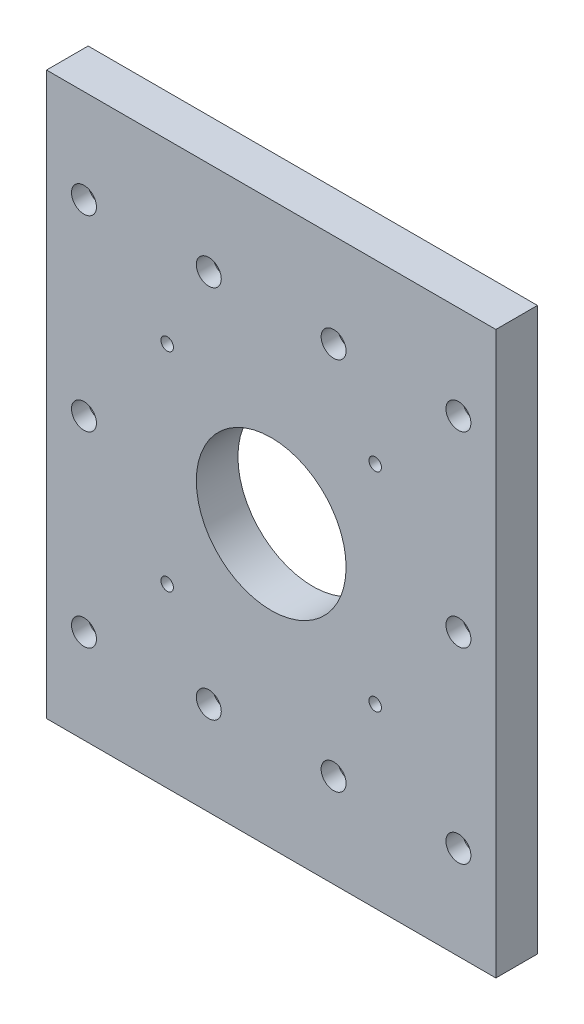
ISO-10303-21;
HEADER;
FILE_DESCRIPTION(('STEP AP214'),'2;1');
FILE_NAME('part.step','',(''),(''),'','','');
FILE_SCHEMA(('AUTOMOTIVE_DESIGN { 1 0 10303 214 1 1 1 1 }'));
ENDSEC;
DATA;
#1=APPLICATION_CONTEXT('core data for automotive mechanical design processes');
#2=APPLICATION_PROTOCOL_DEFINITION('international standard','automotive_design',2000,#1);
#3=PRODUCT_CONTEXT('',#1,'mechanical');
#4=PRODUCT('Part','Part','',(#3));
#5=PRODUCT_RELATED_PRODUCT_CATEGORY('part','',(#4));
#6=PRODUCT_DEFINITION_FORMATION('','',#4);
#7=PRODUCT_DEFINITION_CONTEXT('part definition',#1,'design');
#8=PRODUCT_DEFINITION('design','',#6,#7);
#9=PRODUCT_DEFINITION_SHAPE('','',#8);
#10=(LENGTH_UNIT() NAMED_UNIT(*) SI_UNIT(.MILLI.,.METRE.));
#11=(NAMED_UNIT(*) PLANE_ANGLE_UNIT() SI_UNIT($,.RADIAN.));
#12=(NAMED_UNIT(*) SI_UNIT($,.STERADIAN.) SOLID_ANGLE_UNIT());
#13=UNCERTAINTY_MEASURE_WITH_UNIT(LENGTH_MEASURE(1.E-05),#10,'distance_accuracy_value','');
#14=(GEOMETRIC_REPRESENTATION_CONTEXT(3) GLOBAL_UNCERTAINTY_ASSIGNED_CONTEXT((#13)) GLOBAL_UNIT_ASSIGNED_CONTEXT((#10,
#11,#12)) REPRESENTATION_CONTEXT('',''));
#15=CARTESIAN_POINT('',(0.,0.,0.));
#16=DIRECTION('',(0.,0.,1.));
#17=DIRECTION('',(1.,0.,0.));
#18=AXIS2_PLACEMENT_3D('',#15,#16,#17);
#19=CARTESIAN_POINT('',(5.,22.5,10.));
#20=DIRECTION('',(0.,0.,-1.));
#21=DIRECTION('',(-1.,0.,0.));
#22=AXIS2_PLACEMENT_3D('',#19,#20,#21);
#23=CYLINDRICAL_SURFACE('',#22,3.);
#24=CARTESIAN_POINT('',(5.,22.5,10.));
#25=DIRECTION('',(0.,0.,1.));
#26=DIRECTION('',(1.,0.,0.));
#27=AXIS2_PLACEMENT_3D('',#24,#25,#26);
#28=CIRCLE('',#27,3.);
#29=CARTESIAN_POINT('',(8.,22.5,10.));
#30=VERTEX_POINT('',#29);
#31=EDGE_CURVE('E127',#30,#30,#28,.T.);
#32=ORIENTED_EDGE('',*,*,#31,.T.);
#33=EDGE_LOOP('',(#32));
#34=FACE_BOUND('',#33,.T.);
#35=CARTESIAN_POINT('',(5.,22.5,6.));
#36=DIRECTION('',(0.,0.,-1.));
#37=DIRECTION('',(-1.,0.,0.));
#38=AXIS2_PLACEMENT_3D('',#35,#36,#37);
#39=CIRCLE('',#38,3.);
#40=CARTESIAN_POINT('',(2.,22.5,6.));
#41=VERTEX_POINT('',#40);
#42=EDGE_CURVE('E33',#41,#41,#39,.T.);
#43=ORIENTED_EDGE('',*,*,#42,.T.);
#44=EDGE_LOOP('',(#43));
#45=FACE_BOUND('',#44,.T.);
#46=ADVANCED_FACE('F29',(#34,#45),#23,.F.);
#47=CARTESIAN_POINT('',(-25.,67.5,10.));
#48=DIRECTION('',(0.,0.,-1.));
#49=DIRECTION('',(-1.,0.,0.));
#50=AXIS2_PLACEMENT_3D('',#47,#48,#49);
#51=CYLINDRICAL_SURFACE('',#50,3.);
#52=CARTESIAN_POINT('',(-25.,67.5,10.));
#53=DIRECTION('',(0.,0.,1.));
#54=DIRECTION('',(1.,0.,0.));
#55=AXIS2_PLACEMENT_3D('',#52,#53,#54);
#56=CIRCLE('',#55,3.);
#57=CARTESIAN_POINT('',(-22.,67.5,10.));
#58=VERTEX_POINT('',#57);
#59=EDGE_CURVE('E100',#58,#58,#56,.T.);
#60=ORIENTED_EDGE('',*,*,#59,.T.);
#61=EDGE_LOOP('',(#60));
#62=FACE_BOUND('',#61,.T.);
#63=CARTESIAN_POINT('',(-25.,67.5,6.));
#64=DIRECTION('',(0.,0.,-1.));
#65=DIRECTION('',(-1.,0.,0.));
#66=AXIS2_PLACEMENT_3D('',#63,#64,#65);
#67=CIRCLE('',#66,3.);
#68=CARTESIAN_POINT('',(-28.,67.5,6.));
#69=VERTEX_POINT('',#68);
#70=EDGE_CURVE('E191',#69,#69,#67,.T.);
#71=ORIENTED_EDGE('',*,*,#70,.T.);
#72=EDGE_LOOP('',(#71));
#73=FACE_BOUND('',#72,.T.);
#74=ADVANCED_FACE('F31',(#62,#73),#51,.F.);
#75=CARTESIAN_POINT('',(65.,67.5,10.));
#76=DIRECTION('',(0.,0.,-1.));
#77=DIRECTION('',(-1.,0.,0.));
#78=AXIS2_PLACEMENT_3D('',#75,#76,#77);
#79=CYLINDRICAL_SURFACE('',#78,3.00000000000001);
#80=CARTESIAN_POINT('',(65.,67.5,10.));
#81=DIRECTION('',(0.,0.,1.));
#82=DIRECTION('',(1.,0.,0.));
#83=AXIS2_PLACEMENT_3D('',#80,#81,#82);
#84=CIRCLE('',#83,3.00000000000001);
#85=CARTESIAN_POINT('',(68.,67.5,10.));
#86=VERTEX_POINT('',#85);
#87=EDGE_CURVE('E103',#86,#86,#84,.T.);
#88=ORIENTED_EDGE('',*,*,#87,.T.);
#89=EDGE_LOOP('',(#88));
#90=FACE_BOUND('',#89,.T.);
#91=CARTESIAN_POINT('',(65.,67.5,6.));
#92=DIRECTION('',(0.,0.,-1.));
#93=DIRECTION('',(-1.,0.,0.));
#94=AXIS2_PLACEMENT_3D('',#91,#92,#93);
#95=CIRCLE('',#94,3.00000000000001);
#96=CARTESIAN_POINT('',(62.,67.5,6.));
#97=VERTEX_POINT('',#96);
#98=EDGE_CURVE('E187',#97,#97,#95,.T.);
#99=ORIENTED_EDGE('',*,*,#98,.T.);
#100=EDGE_LOOP('',(#99));
#101=FACE_BOUND('',#100,.T.);
#102=ADVANCED_FACE('F271',(#90,#101),#79,.F.);
#103=CARTESIAN_POINT('',(-25.,112.5,10.));
#104=DIRECTION('',(0.,0.,-1.));
#105=DIRECTION('',(-1.,0.,0.));
#106=AXIS2_PLACEMENT_3D('',#103,#104,#105);
#107=CYLINDRICAL_SURFACE('',#106,3.);
#108=CARTESIAN_POINT('',(-25.,112.5,10.));
#109=DIRECTION('',(0.,0.,1.));
#110=DIRECTION('',(1.,0.,0.));
#111=AXIS2_PLACEMENT_3D('',#108,#109,#110);
#112=CIRCLE('',#111,3.);
#113=CARTESIAN_POINT('',(-22.,112.5,10.));
#114=VERTEX_POINT('',#113);
#115=EDGE_CURVE('E115',#114,#114,#112,.T.);
#116=ORIENTED_EDGE('',*,*,#115,.T.);
#117=EDGE_LOOP('',(#116));
#118=FACE_BOUND('',#117,.T.);
#119=CARTESIAN_POINT('',(-25.,112.5,6.));
#120=DIRECTION('',(0.,0.,-1.));
#121=DIRECTION('',(-1.,0.,0.));
#122=AXIS2_PLACEMENT_3D('',#119,#120,#121);
#123=CIRCLE('',#122,3.);
#124=CARTESIAN_POINT('',(-28.,112.5,6.));
#125=VERTEX_POINT('',#124);
#126=EDGE_CURVE('E182',#125,#125,#123,.T.);
#127=ORIENTED_EDGE('',*,*,#126,.T.);
#128=EDGE_LOOP('',(#127));
#129=FACE_BOUND('',#128,.T.);
#130=ADVANCED_FACE('F284',(#118,#129),#107,.F.);
#131=CARTESIAN_POINT('',(35.,22.5,10.));
#132=DIRECTION('',(0.,0.,-1.));
#133=DIRECTION('',(-1.,0.,0.));
#134=AXIS2_PLACEMENT_3D('',#131,#132,#133);
#135=CYLINDRICAL_SURFACE('',#134,3.);
#136=CARTESIAN_POINT('',(35.,22.5,10.));
#137=DIRECTION('',(0.,0.,1.));
#138=DIRECTION('',(1.,0.,0.));
#139=AXIS2_PLACEMENT_3D('',#136,#137,#138);
#140=CIRCLE('',#139,3.);
#141=CARTESIAN_POINT('',(38.,22.5,10.));
#142=VERTEX_POINT('',#141);
#143=EDGE_CURVE('E118',#142,#142,#140,.T.);
#144=ORIENTED_EDGE('',*,*,#143,.T.);
#145=EDGE_LOOP('',(#144));
#146=FACE_BOUND('',#145,.T.);
#147=CARTESIAN_POINT('',(35.,22.5,6.));
#148=DIRECTION('',(0.,0.,-1.));
#149=DIRECTION('',(-1.,0.,0.));
#150=AXIS2_PLACEMENT_3D('',#147,#148,#149);
#151=CIRCLE('',#150,3.);
#152=CARTESIAN_POINT('',(32.,22.5,6.));
#153=VERTEX_POINT('',#152);
#154=EDGE_CURVE('E177',#153,#153,#151,.T.);
#155=ORIENTED_EDGE('',*,*,#154,.T.);
#156=EDGE_LOOP('',(#155));
#157=FACE_BOUND('',#156,.T.);
#158=ADVANCED_FACE('F280',(#146,#157),#135,.F.);
#159=CARTESIAN_POINT('',(5.,112.5,10.));
#160=DIRECTION('',(0.,0.,-1.));
#161=DIRECTION('',(-1.,0.,0.));
#162=AXIS2_PLACEMENT_3D('',#159,#160,#161);
#163=CYLINDRICAL_SURFACE('',#162,3.);
#164=CARTESIAN_POINT('',(5.,112.5,10.));
#165=DIRECTION('',(0.,0.,1.));
#166=DIRECTION('',(1.,0.,0.));
#167=AXIS2_PLACEMENT_3D('',#164,#165,#166);
#168=CIRCLE('',#167,3.);
#169=CARTESIAN_POINT('',(8.,112.5,10.));
#170=VERTEX_POINT('',#169);
#171=EDGE_CURVE('E139',#170,#170,#168,.T.);
#172=ORIENTED_EDGE('',*,*,#171,.T.);
#173=EDGE_LOOP('',(#172));
#174=FACE_BOUND('',#173,.T.);
#175=CARTESIAN_POINT('',(5.,112.5,6.));
#176=DIRECTION('',(0.,0.,-1.));
#177=DIRECTION('',(-1.,0.,0.));
#178=AXIS2_PLACEMENT_3D('',#175,#176,#177);
#179=CIRCLE('',#178,3.);
#180=CARTESIAN_POINT('',(2.,112.5,6.));
#181=VERTEX_POINT('',#180);
#182=EDGE_CURVE('E172',#181,#181,#179,.T.);
#183=ORIENTED_EDGE('',*,*,#182,.T.);
#184=EDGE_LOOP('',(#183));
#185=FACE_BOUND('',#184,.T.);
#186=ADVANCED_FACE('F283',(#174,#185),#163,.F.);
#187=CARTESIAN_POINT('',(-25.,22.5,10.));
#188=DIRECTION('',(0.,0.,-1.));
#189=DIRECTION('',(-1.,0.,0.));
#190=AXIS2_PLACEMENT_3D('',#187,#188,#189);
#191=CYLINDRICAL_SURFACE('',#190,3.);
#192=CARTESIAN_POINT('',(-25.,22.5,10.));
#193=DIRECTION('',(0.,0.,1.));
#194=DIRECTION('',(1.,0.,0.));
#195=AXIS2_PLACEMENT_3D('',#192,#193,#194);
#196=CIRCLE('',#195,3.);
#197=CARTESIAN_POINT('',(-22.,22.5,10.));
#198=VERTEX_POINT('',#197);
#199=EDGE_CURVE('E106',#198,#198,#196,.T.);
#200=ORIENTED_EDGE('',*,*,#199,.T.);
#201=EDGE_LOOP('',(#200));
#202=FACE_BOUND('',#201,.T.);
#203=CARTESIAN_POINT('',(-25.,22.5,6.));
#204=DIRECTION('',(0.,0.,-1.));
#205=DIRECTION('',(-1.,0.,0.));
#206=AXIS2_PLACEMENT_3D('',#203,#204,#205);
#207=CIRCLE('',#206,3.);
#208=CARTESIAN_POINT('',(-28.,22.5,6.));
#209=VERTEX_POINT('',#208);
#210=EDGE_CURVE('E167',#209,#209,#207,.T.);
#211=ORIENTED_EDGE('',*,*,#210,.T.);
#212=EDGE_LOOP('',(#211));
#213=FACE_BOUND('',#212,.T.);
#214=ADVANCED_FACE('F296',(#202,#213),#191,.F.);
#215=CARTESIAN_POINT('',(65.,22.5,10.));
#216=DIRECTION('',(0.,0.,-1.));
#217=DIRECTION('',(-1.,0.,0.));
#218=AXIS2_PLACEMENT_3D('',#215,#216,#217);
#219=CYLINDRICAL_SURFACE('',#218,3.00000000000001);
#220=CARTESIAN_POINT('',(65.,22.5,10.));
#221=DIRECTION('',(0.,0.,1.));
#222=DIRECTION('',(1.,0.,0.));
#223=AXIS2_PLACEMENT_3D('',#220,#221,#222);
#224=CIRCLE('',#223,3.00000000000001);
#225=CARTESIAN_POINT('',(68.,22.5,10.));
#226=VERTEX_POINT('',#225);
#227=EDGE_CURVE('E109',#226,#226,#224,.T.);
#228=ORIENTED_EDGE('',*,*,#227,.T.);
#229=EDGE_LOOP('',(#228));
#230=FACE_BOUND('',#229,.T.);
#231=CARTESIAN_POINT('',(65.,22.5,6.));
#232=DIRECTION('',(0.,0.,-1.));
#233=DIRECTION('',(-1.,0.,0.));
#234=AXIS2_PLACEMENT_3D('',#231,#232,#233);
#235=CIRCLE('',#234,3.00000000000001);
#236=CARTESIAN_POINT('',(62.,22.5,6.));
#237=VERTEX_POINT('',#236);
#238=EDGE_CURVE('E162',#237,#237,#235,.T.);
#239=ORIENTED_EDGE('',*,*,#238,.T.);
#240=EDGE_LOOP('',(#239));
#241=FACE_BOUND('',#240,.T.);
#242=ADVANCED_FACE('F292',(#230,#241),#219,.F.);
#243=CARTESIAN_POINT('',(65.,112.5,10.));
#244=DIRECTION('',(0.,0.,-1.));
#245=DIRECTION('',(-1.,0.,0.));
#246=AXIS2_PLACEMENT_3D('',#243,#244,#245);
#247=CYLINDRICAL_SURFACE('',#246,3.00000000000001);
#248=CARTESIAN_POINT('',(65.,112.5,10.));
#249=DIRECTION('',(0.,0.,1.));
#250=DIRECTION('',(1.,0.,0.));
#251=AXIS2_PLACEMENT_3D('',#248,#249,#250);
#252=CIRCLE('',#251,3.00000000000001);
#253=CARTESIAN_POINT('',(68.,112.5,10.));
#254=VERTEX_POINT('',#253);
#255=EDGE_CURVE('E112',#254,#254,#252,.T.);
#256=ORIENTED_EDGE('',*,*,#255,.T.);
#257=EDGE_LOOP('',(#256));
#258=FACE_BOUND('',#257,.T.);
#259=CARTESIAN_POINT('',(65.,112.5,6.));
#260=DIRECTION('',(0.,0.,-1.));
#261=DIRECTION('',(-1.,0.,0.));
#262=AXIS2_PLACEMENT_3D('',#259,#260,#261);
#263=CIRCLE('',#262,3.00000000000001);
#264=CARTESIAN_POINT('',(62.,112.5,6.));
#265=VERTEX_POINT('',#264);
#266=EDGE_CURVE('E157',#265,#265,#263,.T.);
#267=ORIENTED_EDGE('',*,*,#266,.T.);
#268=EDGE_LOOP('',(#267));
#269=FACE_BOUND('',#268,.T.);
#270=ADVANCED_FACE('F289',(#258,#269),#247,.F.);
#271=CARTESIAN_POINT('',(35.,112.5,10.));
#272=DIRECTION('',(0.,0.,-1.));
#273=DIRECTION('',(-1.,0.,0.));
#274=AXIS2_PLACEMENT_3D('',#271,#272,#273);
#275=CYLINDRICAL_SURFACE('',#274,3.00000000000001);
#276=CARTESIAN_POINT('',(35.,112.5,10.));
#277=DIRECTION('',(0.,0.,1.));
#278=DIRECTION('',(1.,0.,0.));
#279=AXIS2_PLACEMENT_3D('',#276,#277,#278);
#280=CIRCLE('',#279,3.00000000000001);
#281=CARTESIAN_POINT('',(38.,112.5,10.));
#282=VERTEX_POINT('',#281);
#283=EDGE_CURVE('E130',#282,#282,#280,.T.);
#284=ORIENTED_EDGE('',*,*,#283,.T.);
#285=EDGE_LOOP('',(#284));
#286=FACE_BOUND('',#285,.T.);
#287=CARTESIAN_POINT('',(35.,112.5,6.));
#288=DIRECTION('',(0.,0.,-1.));
#289=DIRECTION('',(-1.,0.,0.));
#290=AXIS2_PLACEMENT_3D('',#287,#288,#289);
#291=CIRCLE('',#290,3.00000000000001);
#292=CARTESIAN_POINT('',(32.,112.5,6.));
#293=VERTEX_POINT('',#292);
#294=EDGE_CURVE('E152',#293,#293,#291,.T.);
#295=ORIENTED_EDGE('',*,*,#294,.T.);
#296=EDGE_LOOP('',(#295));
#297=FACE_BOUND('',#296,.T.);
#298=ADVANCED_FACE('F274',(#286,#297),#275,.F.);
#299=CARTESIAN_POINT('',(-34.,-67.1138906575779,10.));
#300=DIRECTION('',(1.,0.,0.));
#301=DIRECTION('',(0.,1.,0.));
#302=AXIS2_PLACEMENT_3D('',#299,#300,#301);
#303=PLANE('',#302);
#304=DIRECTION('',(0.,-1.,0.));
#305=VECTOR('',#304,1.);
#306=CARTESIAN_POINT('',(-34.,-67.1138906575779,0.));
#307=LINE('',#306,#305);
#308=CARTESIAN_POINT('',(-34.,135.,0.));
#309=VERTEX_POINT('',#308);
#310=CARTESIAN_POINT('',(-34.,0.,0.));
#311=VERTEX_POINT('',#310);
#312=EDGE_CURVE('E79',#309,#311,#307,.T.);
#313=ORIENTED_EDGE('',*,*,#312,.T.);
#314=DIRECTION('',(0.,0.,-1.));
#315=VECTOR('',#314,1.);
#316=CARTESIAN_POINT('',(-34.,0.,10.));
#317=LINE('',#316,#315);
#318=CARTESIAN_POINT('',(-34.,0.,10.));
#319=VERTEX_POINT('',#318);
#320=EDGE_CURVE('E11',#319,#311,#317,.T.);
#321=ORIENTED_EDGE('',*,*,#320,.F.);
#322=DIRECTION('',(0.,-1.,0.));
#323=VECTOR('',#322,1.);
#324=CARTESIAN_POINT('',(-34.,-67.1138906575779,10.));
#325=LINE('',#324,#323);
#326=CARTESIAN_POINT('',(-34.,135.,10.));
#327=VERTEX_POINT('',#326);
#328=EDGE_CURVE('E142',#327,#319,#325,.T.);
#329=ORIENTED_EDGE('',*,*,#328,.F.);
#330=DIRECTION('',(0.,0.,-1.));
#331=VECTOR('',#330,1.);
#332=CARTESIAN_POINT('',(-34.,135.,10.));
#333=LINE('',#332,#331);
#334=EDGE_CURVE('E46',#327,#309,#333,.T.);
#335=ORIENTED_EDGE('',*,*,#334,.T.);
#336=EDGE_LOOP('',(#313,#321,#329,#335));
#337=FACE_BOUND('',#336,.T.);
#338=ADVANCED_FACE('F89',(#337),#303,.F.);
#339=CARTESIAN_POINT('',(20.,0.,10.));
#340=DIRECTION('',(0.,1.,0.));
#341=DIRECTION('',(0.,0.,1.));
#342=AXIS2_PLACEMENT_3D('',#339,#340,#341);
#343=PLANE('',#342);
#344=DIRECTION('',(1.,0.,0.));
#345=VECTOR('',#344,1.);
#346=CARTESIAN_POINT('',(20.,0.,0.));
#347=LINE('',#346,#345);
#348=CARTESIAN_POINT('',(74.,0.,0.));
#349=VERTEX_POINT('',#348);
#350=EDGE_CURVE('E75',#311,#349,#347,.T.);
#351=ORIENTED_EDGE('',*,*,#350,.T.);
#352=DIRECTION('',(0.,0.,-1.));
#353=VECTOR('',#352,1.);
#354=CARTESIAN_POINT('',(74.,0.,10.));
#355=LINE('',#354,#353);
#356=CARTESIAN_POINT('',(74.,0.,10.));
#357=VERTEX_POINT('',#356);
#358=EDGE_CURVE('E38',#357,#349,#355,.T.);
#359=ORIENTED_EDGE('',*,*,#358,.F.);
#360=DIRECTION('',(1.,0.,0.));
#361=VECTOR('',#360,1.);
#362=CARTESIAN_POINT('',(20.,0.,10.));
#363=LINE('',#362,#361);
#364=EDGE_CURVE('E86',#319,#357,#363,.T.);
#365=ORIENTED_EDGE('',*,*,#364,.F.);
#366=ORIENTED_EDGE('',*,*,#320,.T.);
#367=EDGE_LOOP('',(#351,#359,#365,#366));
#368=FACE_BOUND('',#367,.T.);
#369=ADVANCED_FACE('F85',(#368),#343,.F.);
#370=CARTESIAN_POINT('',(74.,-67.1138906575779,10.));
#371=DIRECTION('',(1.,0.,0.));
#372=DIRECTION('',(0.,1.,0.));
#373=AXIS2_PLACEMENT_3D('',#370,#371,#372);
#374=PLANE('',#373);
#375=DIRECTION('',(0.,-1.,0.));
#376=VECTOR('',#375,1.);
#377=CARTESIAN_POINT('',(74.,-67.1138906575779,0.));
#378=LINE('',#377,#376);
#379=CARTESIAN_POINT('',(74.,135.,0.));
#380=VERTEX_POINT('',#379);
#381=EDGE_CURVE('E80',#380,#349,#378,.T.);
#382=ORIENTED_EDGE('',*,*,#381,.F.);
#383=DIRECTION('',(0.,0.,-1.));
#384=VECTOR('',#383,1.);
#385=CARTESIAN_POINT('',(74.,135.,10.));
#386=LINE('',#385,#384);
#387=CARTESIAN_POINT('',(74.,135.,10.));
#388=VERTEX_POINT('',#387);
#389=EDGE_CURVE('E54',#388,#380,#386,.T.);
#390=ORIENTED_EDGE('',*,*,#389,.F.);
#391=DIRECTION('',(0.,-1.,0.));
#392=VECTOR('',#391,1.);
#393=CARTESIAN_POINT('',(74.,-67.1138906575779,10.));
#394=LINE('',#393,#392);
#395=EDGE_CURVE('E145',#388,#357,#394,.T.);
#396=ORIENTED_EDGE('',*,*,#395,.T.);
#397=ORIENTED_EDGE('',*,*,#358,.T.);
#398=EDGE_LOOP('',(#382,#390,#396,#397));
#399=FACE_BOUND('',#398,.T.);
#400=ADVANCED_FACE('F260',(#399),#374,.T.);
#401=CARTESIAN_POINT('',(45.0000000000012,92.4999999999997,10.));
#402=DIRECTION('',(0.,0.,-1.));
#403=DIRECTION('',(-1.,0.,0.));
#404=AXIS2_PLACEMENT_3D('',#401,#402,#403);
#405=CYLINDRICAL_SURFACE('',#404,1.49999999999891);
#406=CARTESIAN_POINT('',(45.0000000000012,92.4999999999997,10.));
#407=DIRECTION('',(0.,0.,1.));
#408=DIRECTION('',(1.,0.,0.));
#409=AXIS2_PLACEMENT_3D('',#406,#407,#408);
#410=CIRCLE('',#409,1.49999999999891);
#411=CARTESIAN_POINT('',(46.5000000000001,92.4999999999997,10.));
#412=VERTEX_POINT('',#411);
#413=EDGE_CURVE('E136',#412,#412,#410,.T.);
#414=ORIENTED_EDGE('',*,*,#413,.T.);
#415=EDGE_LOOP('',(#414));
#416=FACE_BOUND('',#415,.T.);
#417=CARTESIAN_POINT('',(45.0000000000012,92.4999999999997,0.));
#418=DIRECTION('',(0.,0.,1.));
#419=DIRECTION('',(1.,0.,0.));
#420=AXIS2_PLACEMENT_3D('',#417,#418,#419);
#421=CIRCLE('',#420,1.49999999999891);
#422=CARTESIAN_POINT('',(46.5000000000001,92.4999999999997,0.));
#423=VERTEX_POINT('',#422);
#424=EDGE_CURVE('E90',#423,#423,#421,.T.);
#425=ORIENTED_EDGE('',*,*,#424,.F.);
#426=EDGE_LOOP('',(#425));
#427=FACE_BOUND('',#426,.T.);
#428=ADVANCED_FACE('F250',(#416,#427),#405,.F.);
#429=CARTESIAN_POINT('',(45.0000000000012,42.4999999999997,10.));
#430=DIRECTION('',(0.,0.,-1.));
#431=DIRECTION('',(-1.,0.,0.));
#432=AXIS2_PLACEMENT_3D('',#429,#430,#431);
#433=CYLINDRICAL_SURFACE('',#432,1.49999999999891);
#434=CARTESIAN_POINT('',(45.0000000000012,42.4999999999997,10.));
#435=DIRECTION('',(0.,0.,1.));
#436=DIRECTION('',(1.,0.,0.));
#437=AXIS2_PLACEMENT_3D('',#434,#435,#436);
#438=CIRCLE('',#437,1.49999999999891);
#439=CARTESIAN_POINT('',(46.5000000000001,42.4999999999997,10.));
#440=VERTEX_POINT('',#439);
#441=EDGE_CURVE('E133',#440,#440,#438,.T.);
#442=ORIENTED_EDGE('',*,*,#441,.T.);
#443=EDGE_LOOP('',(#442));
#444=FACE_BOUND('',#443,.T.);
#445=CARTESIAN_POINT('',(45.0000000000012,42.4999999999997,0.));
#446=DIRECTION('',(0.,0.,1.));
#447=DIRECTION('',(1.,0.,0.));
#448=AXIS2_PLACEMENT_3D('',#445,#446,#447);
#449=CIRCLE('',#448,1.49999999999891);
#450=CARTESIAN_POINT('',(46.5000000000001,42.4999999999997,0.));
#451=VERTEX_POINT('',#450);
#452=EDGE_CURVE('E93',#451,#451,#449,.T.);
#453=ORIENTED_EDGE('',*,*,#452,.F.);
#454=EDGE_LOOP('',(#453));
#455=FACE_BOUND('',#454,.T.);
#456=ADVANCED_FACE('F247',(#444,#455),#433,.F.);
#457=CARTESIAN_POINT('',(-4.99999999999881,42.4999999999997,10.));
#458=DIRECTION('',(0.,0.,-1.));
#459=DIRECTION('',(-1.,0.,0.));
#460=AXIS2_PLACEMENT_3D('',#457,#458,#459);
#461=CYLINDRICAL_SURFACE('',#460,1.49999999999891);
#462=CARTESIAN_POINT('',(-4.99999999999881,42.4999999999997,10.));
#463=DIRECTION('',(0.,0.,1.));
#464=DIRECTION('',(1.,0.,0.));
#465=AXIS2_PLACEMENT_3D('',#462,#463,#464);
#466=CIRCLE('',#465,1.49999999999891);
#467=CARTESIAN_POINT('',(-3.4999999999999,42.4999999999997,10.));
#468=VERTEX_POINT('',#467);
#469=EDGE_CURVE('E124',#468,#468,#466,.T.);
#470=ORIENTED_EDGE('',*,*,#469,.T.);
#471=EDGE_LOOP('',(#470));
#472=FACE_BOUND('',#471,.T.);
#473=CARTESIAN_POINT('',(-4.99999999999881,42.4999999999997,0.));
#474=DIRECTION('',(0.,0.,1.));
#475=DIRECTION('',(1.,0.,0.));
#476=AXIS2_PLACEMENT_3D('',#473,#474,#475);
#477=CIRCLE('',#476,1.49999999999891);
#478=CARTESIAN_POINT('',(-3.4999999999999,42.4999999999997,0.));
#479=VERTEX_POINT('',#478);
#480=EDGE_CURVE('E240',#479,#479,#477,.T.);
#481=ORIENTED_EDGE('',*,*,#480,.F.);
#482=EDGE_LOOP('',(#481));
#483=FACE_BOUND('',#482,.T.);
#484=ADVANCED_FACE('F249',(#472,#483),#461,.F.);
#485=CARTESIAN_POINT('',(-4.9999999999988,92.4999999999997,10.));
#486=DIRECTION('',(0.,0.,-1.));
#487=DIRECTION('',(-1.,0.,0.));
#488=AXIS2_PLACEMENT_3D('',#485,#486,#487);
#489=CYLINDRICAL_SURFACE('',#488,1.49999999999891);
#490=CARTESIAN_POINT('',(-4.9999999999988,92.4999999999997,10.));
#491=DIRECTION('',(0.,0.,1.));
#492=DIRECTION('',(1.,0.,0.));
#493=AXIS2_PLACEMENT_3D('',#490,#491,#492);
#494=CIRCLE('',#493,1.49999999999891);
#495=CARTESIAN_POINT('',(-3.49999999999988,92.4999999999997,10.));
#496=VERTEX_POINT('',#495);
#497=EDGE_CURVE('E121',#496,#496,#494,.T.);
#498=ORIENTED_EDGE('',*,*,#497,.T.);
#499=EDGE_LOOP('',(#498));
#500=FACE_BOUND('',#499,.T.);
#501=CARTESIAN_POINT('',(-4.9999999999988,92.4999999999997,0.));
#502=DIRECTION('',(0.,0.,1.));
#503=DIRECTION('',(1.,0.,0.));
#504=AXIS2_PLACEMENT_3D('',#501,#502,#503);
#505=CIRCLE('',#504,1.49999999999891);
#506=CARTESIAN_POINT('',(-3.49999999999988,92.4999999999997,0.));
#507=VERTEX_POINT('',#506);
#508=EDGE_CURVE('E155',#507,#507,#505,.T.);
#509=ORIENTED_EDGE('',*,*,#508,.F.);
#510=EDGE_LOOP('',(#509));
#511=FACE_BOUND('',#510,.T.);
#512=ADVANCED_FACE('F257',(#500,#511),#489,.F.);
#513=CARTESIAN_POINT('',(20.,135.,10.));
#514=DIRECTION('',(0.,1.,0.));
#515=DIRECTION('',(0.,0.,1.));
#516=AXIS2_PLACEMENT_3D('',#513,#514,#515);
#517=PLANE('',#516);
#518=DIRECTION('',(1.,0.,0.));
#519=VECTOR('',#518,1.);
#520=CARTESIAN_POINT('',(20.,135.,0.));
#521=LINE('',#520,#519);
#522=EDGE_CURVE('E98',#309,#380,#521,.T.);
#523=ORIENTED_EDGE('',*,*,#522,.F.);
#524=ORIENTED_EDGE('',*,*,#334,.F.);
#525=DIRECTION('',(1.,0.,0.));
#526=VECTOR('',#525,1.);
#527=CARTESIAN_POINT('',(20.,135.,10.));
#528=LINE('',#527,#526);
#529=EDGE_CURVE('E147',#327,#388,#528,.T.);
#530=ORIENTED_EDGE('',*,*,#529,.T.);
#531=ORIENTED_EDGE('',*,*,#389,.T.);
#532=EDGE_LOOP('',(#523,#524,#530,#531));
#533=FACE_BOUND('',#532,.T.);
#534=ADVANCED_FACE('F278',(#533),#517,.T.);
#535=CARTESIAN_POINT('',(20.,-67.1138906575779,10.));
#536=DIRECTION('',(0.,0.,1.));
#537=DIRECTION('',(1.,0.,0.));
#538=AXIS2_PLACEMENT_3D('',#535,#536,#537);
#539=PLANE('',#538);
#540=CARTESIAN_POINT('',(20.,67.5,10.));
#541=DIRECTION('',(0.,0.,1.));
#542=DIRECTION('',(1.,0.,0.));
#543=AXIS2_PLACEMENT_3D('',#540,#541,#542);
#544=CIRCLE('',#543,18.);
#545=CARTESIAN_POINT('',(38.,67.5,10.));
#546=VERTEX_POINT('',#545);
#547=EDGE_CURVE('E648',#546,#546,#544,.T.);
#548=ORIENTED_EDGE('',*,*,#547,.F.);
#549=EDGE_LOOP('',(#548));
#550=FACE_BOUND('',#549,.T.);
#551=ORIENTED_EDGE('',*,*,#59,.F.);
#552=EDGE_LOOP('',(#551));
#553=FACE_BOUND('',#552,.T.);
#554=ORIENTED_EDGE('',*,*,#87,.F.);
#555=EDGE_LOOP('',(#554));
#556=FACE_BOUND('',#555,.T.);
#557=ORIENTED_EDGE('',*,*,#199,.F.);
#558=EDGE_LOOP('',(#557));
#559=FACE_BOUND('',#558,.T.);
#560=ORIENTED_EDGE('',*,*,#227,.F.);
#561=EDGE_LOOP('',(#560));
#562=FACE_BOUND('',#561,.T.);
#563=ORIENTED_EDGE('',*,*,#255,.F.);
#564=EDGE_LOOP('',(#563));
#565=FACE_BOUND('',#564,.T.);
#566=ORIENTED_EDGE('',*,*,#115,.F.);
#567=EDGE_LOOP('',(#566));
#568=FACE_BOUND('',#567,.T.);
#569=ORIENTED_EDGE('',*,*,#143,.F.);
#570=EDGE_LOOP('',(#569));
#571=FACE_BOUND('',#570,.T.);
#572=ORIENTED_EDGE('',*,*,#497,.F.);
#573=EDGE_LOOP('',(#572));
#574=FACE_BOUND('',#573,.T.);
#575=ORIENTED_EDGE('',*,*,#469,.F.);
#576=EDGE_LOOP('',(#575));
#577=FACE_BOUND('',#576,.T.);
#578=ORIENTED_EDGE('',*,*,#31,.F.);
#579=EDGE_LOOP('',(#578));
#580=FACE_BOUND('',#579,.T.);
#581=ORIENTED_EDGE('',*,*,#283,.F.);
#582=EDGE_LOOP('',(#581));
#583=FACE_BOUND('',#582,.T.);
#584=ORIENTED_EDGE('',*,*,#441,.F.);
#585=EDGE_LOOP('',(#584));
#586=FACE_BOUND('',#585,.T.);
#587=ORIENTED_EDGE('',*,*,#413,.F.);
#588=EDGE_LOOP('',(#587));
#589=FACE_BOUND('',#588,.T.);
#590=ORIENTED_EDGE('',*,*,#171,.F.);
#591=EDGE_LOOP('',(#590));
#592=FACE_BOUND('',#591,.T.);
#593=ORIENTED_EDGE('',*,*,#328,.T.);
#594=ORIENTED_EDGE('',*,*,#364,.T.);
#595=ORIENTED_EDGE('',*,*,#395,.F.);
#596=ORIENTED_EDGE('',*,*,#529,.F.);
#597=EDGE_LOOP('',(#593,#594,#595,#596));
#598=FACE_BOUND('',#597,.T.);
#599=ADVANCED_FACE('F325',(#550,#553,#556,#559,#562,#565,#568,#571,#574,#577,#580,#583,#586,
#589,#592,#598),#539,.T.);
#600=CARTESIAN_POINT('',(20.,-67.1138906575779,0.));
#601=DIRECTION('',(0.,0.,1.));
#602=DIRECTION('',(1.,0.,0.));
#603=AXIS2_PLACEMENT_3D('',#600,#601,#602);
#604=PLANE('',#603);
#605=CARTESIAN_POINT('',(20.,67.5,0.));
#606=DIRECTION('',(0.,0.,-1.));
#607=DIRECTION('',(-1.,0.,0.));
#608=AXIS2_PLACEMENT_3D('',#605,#606,#607);
#609=CIRCLE('',#608,18.);
#610=CARTESIAN_POINT('',(2.,67.5,0.));
#611=VERTEX_POINT('',#610);
#612=EDGE_CURVE('E651',#611,#611,#609,.T.);
#613=ORIENTED_EDGE('',*,*,#612,.F.);
#614=EDGE_LOOP('',(#613));
#615=FACE_BOUND('',#614,.T.);
#616=CARTESIAN_POINT('',(5.,22.5,0.));
#617=DIRECTION('',(0.,0.,-1.));
#618=DIRECTION('',(-1.,0.,0.));
#619=AXIS2_PLACEMENT_3D('',#616,#617,#618);
#620=CIRCLE('',#619,5.);
#621=CARTESIAN_POINT('',(0.,22.5,0.));
#622=VERTEX_POINT('',#621);
#623=EDGE_CURVE('E653',#622,#622,#620,.T.);
#624=ORIENTED_EDGE('',*,*,#623,.F.);
#625=EDGE_LOOP('',(#624));
#626=FACE_BOUND('',#625,.T.);
#627=CARTESIAN_POINT('',(-25.,67.5,0.));
#628=DIRECTION('',(0.,0.,-1.));
#629=DIRECTION('',(-1.,0.,0.));
#630=AXIS2_PLACEMENT_3D('',#627,#628,#629);
#631=CIRCLE('',#630,5.);
#632=CARTESIAN_POINT('',(-30.,67.5,0.));
#633=VERTEX_POINT('',#632);
#634=EDGE_CURVE('E200',#633,#633,#631,.T.);
#635=ORIENTED_EDGE('',*,*,#634,.F.);
#636=EDGE_LOOP('',(#635));
#637=FACE_BOUND('',#636,.T.);
#638=CARTESIAN_POINT('',(65.,67.5,0.));
#639=DIRECTION('',(0.,0.,-1.));
#640=DIRECTION('',(-1.,0.,0.));
#641=AXIS2_PLACEMENT_3D('',#638,#639,#640);
#642=CIRCLE('',#641,5.);
#643=CARTESIAN_POINT('',(60.,67.5,0.));
#644=VERTEX_POINT('',#643);
#645=EDGE_CURVE('E193',#644,#644,#642,.T.);
#646=ORIENTED_EDGE('',*,*,#645,.F.);
#647=EDGE_LOOP('',(#646));
#648=FACE_BOUND('',#647,.T.);
#649=CARTESIAN_POINT('',(-25.,112.5,0.));
#650=DIRECTION('',(0.,0.,-1.));
#651=DIRECTION('',(-1.,0.,0.));
#652=AXIS2_PLACEMENT_3D('',#649,#650,#651);
#653=CIRCLE('',#652,5.);
#654=CARTESIAN_POINT('',(-30.,112.5,0.));
#655=VERTEX_POINT('',#654);
#656=EDGE_CURVE('E189',#655,#655,#653,.T.);
#657=ORIENTED_EDGE('',*,*,#656,.F.);
#658=EDGE_LOOP('',(#657));
#659=FACE_BOUND('',#658,.T.);
#660=CARTESIAN_POINT('',(35.,22.5,0.));
#661=DIRECTION('',(0.,0.,-1.));
#662=DIRECTION('',(-1.,0.,0.));
#663=AXIS2_PLACEMENT_3D('',#660,#661,#662);
#664=CIRCLE('',#663,5.);
#665=CARTESIAN_POINT('',(30.,22.5,0.));
#666=VERTEX_POINT('',#665);
#667=EDGE_CURVE('E185',#666,#666,#664,.T.);
#668=ORIENTED_EDGE('',*,*,#667,.F.);
#669=EDGE_LOOP('',(#668));
#670=FACE_BOUND('',#669,.T.);
#671=CARTESIAN_POINT('',(5.,112.5,0.));
#672=DIRECTION('',(0.,0.,-1.));
#673=DIRECTION('',(-1.,0.,0.));
#674=AXIS2_PLACEMENT_3D('',#671,#672,#673);
#675=CIRCLE('',#674,5.);
#676=CARTESIAN_POINT('',(0.,112.5,0.));
#677=VERTEX_POINT('',#676);
#678=EDGE_CURVE('E180',#677,#677,#675,.T.);
#679=ORIENTED_EDGE('',*,*,#678,.F.);
#680=EDGE_LOOP('',(#679));
#681=FACE_BOUND('',#680,.T.);
#682=CARTESIAN_POINT('',(-25.,22.5,0.));
#683=DIRECTION('',(0.,0.,-1.));
#684=DIRECTION('',(-1.,0.,0.));
#685=AXIS2_PLACEMENT_3D('',#682,#683,#684);
#686=CIRCLE('',#685,5.);
#687=CARTESIAN_POINT('',(-30.,22.5,0.));
#688=VERTEX_POINT('',#687);
#689=EDGE_CURVE('E175',#688,#688,#686,.T.);
#690=ORIENTED_EDGE('',*,*,#689,.F.);
#691=EDGE_LOOP('',(#690));
#692=FACE_BOUND('',#691,.T.);
#693=CARTESIAN_POINT('',(65.,22.5,0.));
#694=DIRECTION('',(0.,0.,-1.));
#695=DIRECTION('',(-1.,0.,0.));
#696=AXIS2_PLACEMENT_3D('',#693,#694,#695);
#697=CIRCLE('',#696,5.);
#698=CARTESIAN_POINT('',(60.,22.5,0.));
#699=VERTEX_POINT('',#698);
#700=EDGE_CURVE('E170',#699,#699,#697,.T.);
#701=ORIENTED_EDGE('',*,*,#700,.F.);
#702=EDGE_LOOP('',(#701));
#703=FACE_BOUND('',#702,.T.);
#704=CARTESIAN_POINT('',(65.,112.5,0.));
#705=DIRECTION('',(0.,0.,-1.));
#706=DIRECTION('',(-1.,0.,0.));
#707=AXIS2_PLACEMENT_3D('',#704,#705,#706);
#708=CIRCLE('',#707,5.);
#709=CARTESIAN_POINT('',(60.,112.5,0.));
#710=VERTEX_POINT('',#709);
#711=EDGE_CURVE('E165',#710,#710,#708,.T.);
#712=ORIENTED_EDGE('',*,*,#711,.F.);
#713=EDGE_LOOP('',(#712));
#714=FACE_BOUND('',#713,.T.);
#715=CARTESIAN_POINT('',(35.,112.5,0.));
#716=DIRECTION('',(0.,0.,-1.));
#717=DIRECTION('',(-1.,0.,0.));
#718=AXIS2_PLACEMENT_3D('',#715,#716,#717);
#719=CIRCLE('',#718,5.);
#720=CARTESIAN_POINT('',(30.,112.5,0.));
#721=VERTEX_POINT('',#720);
#722=EDGE_CURVE('E160',#721,#721,#719,.T.);
#723=ORIENTED_EDGE('',*,*,#722,.F.);
#724=EDGE_LOOP('',(#723));
#725=FACE_BOUND('',#724,.T.);
#726=ORIENTED_EDGE('',*,*,#508,.T.);
#727=EDGE_LOOP('',(#726));
#728=FACE_BOUND('',#727,.T.);
#729=ORIENTED_EDGE('',*,*,#480,.T.);
#730=EDGE_LOOP('',(#729));
#731=FACE_BOUND('',#730,.T.);
#732=ORIENTED_EDGE('',*,*,#452,.T.);
#733=EDGE_LOOP('',(#732));
#734=FACE_BOUND('',#733,.T.);
#735=ORIENTED_EDGE('',*,*,#424,.T.);
#736=EDGE_LOOP('',(#735));
#737=FACE_BOUND('',#736,.T.);
#738=ORIENTED_EDGE('',*,*,#312,.F.);
#739=ORIENTED_EDGE('',*,*,#522,.T.);
#740=ORIENTED_EDGE('',*,*,#381,.T.);
#741=ORIENTED_EDGE('',*,*,#350,.F.);
#742=EDGE_LOOP('',(#738,#739,#740,#741));
#743=FACE_BOUND('',#742,.T.);
#744=ADVANCED_FACE('F76',(#615,#626,#637,#648,#659,#670,#681,#692,#703,#714,#725,#728,#731,#734,
#737,#743),#604,.F.);
#745=CARTESIAN_POINT('',(35.,112.5,6.));
#746=DIRECTION('',(0.,0.,-1.));
#747=DIRECTION('',(-1.,0.,0.));
#748=AXIS2_PLACEMENT_3D('',#745,#746,#747);
#749=CYLINDRICAL_SURFACE('',#748,5.);
#750=CARTESIAN_POINT('',(35.,112.5,6.));
#751=DIRECTION('',(0.,0.,-1.));
#752=DIRECTION('',(-1.,0.,0.));
#753=AXIS2_PLACEMENT_3D('',#750,#751,#752);
#754=CIRCLE('',#753,5.);
#755=CARTESIAN_POINT('',(30.,112.5,6.));
#756=VERTEX_POINT('',#755);
#757=EDGE_CURVE('E156',#756,#756,#754,.T.);
#758=ORIENTED_EDGE('',*,*,#757,.F.);
#759=EDGE_LOOP('',(#758));
#760=FACE_BOUND('',#759,.T.);
#761=ORIENTED_EDGE('',*,*,#722,.T.);
#762=EDGE_LOOP('',(#761));
#763=FACE_BOUND('',#762,.T.);
#764=ADVANCED_FACE('F324',(#760,#763),#749,.F.);
#765=CARTESIAN_POINT('',(35.,112.5,6.));
#766=DIRECTION('',(0.,0.,-1.));
#767=DIRECTION('',(-1.,0.,0.));
#768=AXIS2_PLACEMENT_3D('',#765,#766,#767);
#769=PLANE('',#768);
#770=ORIENTED_EDGE('',*,*,#294,.F.);
#771=EDGE_LOOP('',(#770));
#772=FACE_BOUND('',#771,.T.);
#773=ORIENTED_EDGE('',*,*,#757,.T.);
#774=EDGE_LOOP('',(#773));
#775=FACE_BOUND('',#774,.T.);
#776=ADVANCED_FACE('F349',(#772,#775),#769,.T.);
#777=CARTESIAN_POINT('',(65.,112.5,6.));
#778=DIRECTION('',(0.,0.,-1.));
#779=DIRECTION('',(-1.,0.,0.));
#780=AXIS2_PLACEMENT_3D('',#777,#778,#779);
#781=CYLINDRICAL_SURFACE('',#780,5.);
#782=CARTESIAN_POINT('',(65.,112.5,6.));
#783=DIRECTION('',(0.,0.,-1.));
#784=DIRECTION('',(-1.,0.,0.));
#785=AXIS2_PLACEMENT_3D('',#782,#783,#784);
#786=CIRCLE('',#785,5.);
#787=CARTESIAN_POINT('',(60.,112.5,6.));
#788=VERTEX_POINT('',#787);
#789=EDGE_CURVE('E161',#788,#788,#786,.T.);
#790=ORIENTED_EDGE('',*,*,#789,.F.);
#791=EDGE_LOOP('',(#790));
#792=FACE_BOUND('',#791,.T.);
#793=ORIENTED_EDGE('',*,*,#711,.T.);
#794=EDGE_LOOP('',(#793));
#795=FACE_BOUND('',#794,.T.);
#796=ADVANCED_FACE('F356',(#792,#795),#781,.F.);
#797=CARTESIAN_POINT('',(65.,112.5,6.));
#798=DIRECTION('',(0.,0.,-1.));
#799=DIRECTION('',(-1.,0.,0.));
#800=AXIS2_PLACEMENT_3D('',#797,#798,#799);
#801=PLANE('',#800);
#802=ORIENTED_EDGE('',*,*,#266,.F.);
#803=EDGE_LOOP('',(#802));
#804=FACE_BOUND('',#803,.T.);
#805=ORIENTED_EDGE('',*,*,#789,.T.);
#806=EDGE_LOOP('',(#805));
#807=FACE_BOUND('',#806,.T.);
#808=ADVANCED_FACE('F410',(#804,#807),#801,.T.);
#809=CARTESIAN_POINT('',(65.,22.5,6.));
#810=DIRECTION('',(0.,0.,-1.));
#811=DIRECTION('',(-1.,0.,0.));
#812=AXIS2_PLACEMENT_3D('',#809,#810,#811);
#813=CYLINDRICAL_SURFACE('',#812,5.);
#814=CARTESIAN_POINT('',(65.,22.5,6.));
#815=DIRECTION('',(0.,0.,-1.));
#816=DIRECTION('',(-1.,0.,0.));
#817=AXIS2_PLACEMENT_3D('',#814,#815,#816);
#818=CIRCLE('',#817,5.);
#819=CARTESIAN_POINT('',(60.,22.5,6.));
#820=VERTEX_POINT('',#819);
#821=EDGE_CURVE('E166',#820,#820,#818,.T.);
#822=ORIENTED_EDGE('',*,*,#821,.F.);
#823=EDGE_LOOP('',(#822));
#824=FACE_BOUND('',#823,.T.);
#825=ORIENTED_EDGE('',*,*,#700,.T.);
#826=EDGE_LOOP('',(#825));
#827=FACE_BOUND('',#826,.T.);
#828=ADVANCED_FACE('F406',(#824,#827),#813,.F.);
#829=CARTESIAN_POINT('',(65.,22.5,6.));
#830=DIRECTION('',(0.,0.,-1.));
#831=DIRECTION('',(-1.,0.,0.));
#832=AXIS2_PLACEMENT_3D('',#829,#830,#831);
#833=PLANE('',#832);
#834=ORIENTED_EDGE('',*,*,#238,.F.);
#835=EDGE_LOOP('',(#834));
#836=FACE_BOUND('',#835,.T.);
#837=ORIENTED_EDGE('',*,*,#821,.T.);
#838=EDGE_LOOP('',(#837));
#839=FACE_BOUND('',#838,.T.);
#840=ADVANCED_FACE('F402',(#836,#839),#833,.T.);
#841=CARTESIAN_POINT('',(-25.,22.5,6.));
#842=DIRECTION('',(0.,0.,-1.));
#843=DIRECTION('',(-1.,0.,0.));
#844=AXIS2_PLACEMENT_3D('',#841,#842,#843);
#845=CYLINDRICAL_SURFACE('',#844,5.);
#846=CARTESIAN_POINT('',(-25.,22.5,6.));
#847=DIRECTION('',(0.,0.,-1.));
#848=DIRECTION('',(-1.,0.,0.));
#849=AXIS2_PLACEMENT_3D('',#846,#847,#848);
#850=CIRCLE('',#849,5.);
#851=CARTESIAN_POINT('',(-30.,22.5,6.));
#852=VERTEX_POINT('',#851);
#853=EDGE_CURVE('E171',#852,#852,#850,.T.);
#854=ORIENTED_EDGE('',*,*,#853,.F.);
#855=EDGE_LOOP('',(#854));
#856=FACE_BOUND('',#855,.T.);
#857=ORIENTED_EDGE('',*,*,#689,.T.);
#858=EDGE_LOOP('',(#857));
#859=FACE_BOUND('',#858,.T.);
#860=ADVANCED_FACE('F395',(#856,#859),#845,.F.);
#861=CARTESIAN_POINT('',(-25.,22.5,6.));
#862=DIRECTION('',(0.,0.,-1.));
#863=DIRECTION('',(-1.,0.,0.));
#864=AXIS2_PLACEMENT_3D('',#861,#862,#863);
#865=PLANE('',#864);
#866=ORIENTED_EDGE('',*,*,#210,.F.);
#867=EDGE_LOOP('',(#866));
#868=FACE_BOUND('',#867,.T.);
#869=ORIENTED_EDGE('',*,*,#853,.T.);
#870=EDGE_LOOP('',(#869));
#871=FACE_BOUND('',#870,.T.);
#872=ADVANCED_FACE('F390',(#868,#871),#865,.T.);
#873=CARTESIAN_POINT('',(5.,112.5,6.));
#874=DIRECTION('',(0.,0.,-1.));
#875=DIRECTION('',(-1.,0.,0.));
#876=AXIS2_PLACEMENT_3D('',#873,#874,#875);
#877=CYLINDRICAL_SURFACE('',#876,5.);
#878=CARTESIAN_POINT('',(5.,112.5,6.));
#879=DIRECTION('',(0.,0.,-1.));
#880=DIRECTION('',(-1.,0.,0.));
#881=AXIS2_PLACEMENT_3D('',#878,#879,#880);
#882=CIRCLE('',#881,5.);
#883=CARTESIAN_POINT('',(0.,112.5,6.));
#884=VERTEX_POINT('',#883);
#885=EDGE_CURVE('E176',#884,#884,#882,.T.);
#886=ORIENTED_EDGE('',*,*,#885,.F.);
#887=EDGE_LOOP('',(#886));
#888=FACE_BOUND('',#887,.T.);
#889=ORIENTED_EDGE('',*,*,#678,.T.);
#890=EDGE_LOOP('',(#889));
#891=FACE_BOUND('',#890,.T.);
#892=ADVANCED_FACE('F384',(#888,#891),#877,.F.);
#893=CARTESIAN_POINT('',(5.,112.5,6.));
#894=DIRECTION('',(0.,0.,-1.));
#895=DIRECTION('',(-1.,0.,0.));
#896=AXIS2_PLACEMENT_3D('',#893,#894,#895);
#897=PLANE('',#896);
#898=ORIENTED_EDGE('',*,*,#182,.F.);
#899=EDGE_LOOP('',(#898));
#900=FACE_BOUND('',#899,.T.);
#901=ORIENTED_EDGE('',*,*,#885,.T.);
#902=EDGE_LOOP('',(#901));
#903=FACE_BOUND('',#902,.T.);
#904=ADVANCED_FACE('F380',(#900,#903),#897,.T.);
#905=CARTESIAN_POINT('',(35.,22.5,6.));
#906=DIRECTION('',(0.,0.,-1.));
#907=DIRECTION('',(-1.,0.,0.));
#908=AXIS2_PLACEMENT_3D('',#905,#906,#907);
#909=CYLINDRICAL_SURFACE('',#908,5.);
#910=CARTESIAN_POINT('',(35.,22.5,6.));
#911=DIRECTION('',(0.,0.,-1.));
#912=DIRECTION('',(-1.,0.,0.));
#913=AXIS2_PLACEMENT_3D('',#910,#911,#912);
#914=CIRCLE('',#913,5.);
#915=CARTESIAN_POINT('',(30.,22.5,6.));
#916=VERTEX_POINT('',#915);
#917=EDGE_CURVE('E181',#916,#916,#914,.T.);
#918=ORIENTED_EDGE('',*,*,#917,.F.);
#919=EDGE_LOOP('',(#918));
#920=FACE_BOUND('',#919,.T.);
#921=ORIENTED_EDGE('',*,*,#667,.T.);
#922=EDGE_LOOP('',(#921));
#923=FACE_BOUND('',#922,.T.);
#924=ADVANCED_FACE('F383',(#920,#923),#909,.F.);
#925=CARTESIAN_POINT('',(35.,22.5,6.));
#926=DIRECTION('',(0.,0.,-1.));
#927=DIRECTION('',(-1.,0.,0.));
#928=AXIS2_PLACEMENT_3D('',#925,#926,#927);
#929=PLANE('',#928);
#930=ORIENTED_EDGE('',*,*,#154,.F.);
#931=EDGE_LOOP('',(#930));
#932=FACE_BOUND('',#931,.T.);
#933=ORIENTED_EDGE('',*,*,#917,.T.);
#934=EDGE_LOOP('',(#933));
#935=FACE_BOUND('',#934,.T.);
#936=ADVANCED_FACE('F456',(#932,#935),#929,.T.);
#937=CARTESIAN_POINT('',(-25.,112.5,6.));
#938=DIRECTION('',(0.,0.,-1.));
#939=DIRECTION('',(-1.,0.,0.));
#940=AXIS2_PLACEMENT_3D('',#937,#938,#939);
#941=CYLINDRICAL_SURFACE('',#940,5.);
#942=CARTESIAN_POINT('',(-25.,112.5,6.));
#943=DIRECTION('',(0.,0.,-1.));
#944=DIRECTION('',(-1.,0.,0.));
#945=AXIS2_PLACEMENT_3D('',#942,#943,#944);
#946=CIRCLE('',#945,5.);
#947=CARTESIAN_POINT('',(-30.,112.5,6.));
#948=VERTEX_POINT('',#947);
#949=EDGE_CURVE('E186',#948,#948,#946,.T.);
#950=ORIENTED_EDGE('',*,*,#949,.F.);
#951=EDGE_LOOP('',(#950));
#952=FACE_BOUND('',#951,.T.);
#953=ORIENTED_EDGE('',*,*,#656,.T.);
#954=EDGE_LOOP('',(#953));
#955=FACE_BOUND('',#954,.T.);
#956=ADVANCED_FACE('F463',(#952,#955),#941,.F.);
#957=CARTESIAN_POINT('',(-25.,112.5,6.));
#958=DIRECTION('',(0.,0.,-1.));
#959=DIRECTION('',(-1.,0.,0.));
#960=AXIS2_PLACEMENT_3D('',#957,#958,#959);
#961=PLANE('',#960);
#962=ORIENTED_EDGE('',*,*,#126,.F.);
#963=EDGE_LOOP('',(#962));
#964=FACE_BOUND('',#963,.T.);
#965=ORIENTED_EDGE('',*,*,#949,.T.);
#966=EDGE_LOOP('',(#965));
#967=FACE_BOUND('',#966,.T.);
#968=ADVANCED_FACE('F318',(#964,#967),#961,.T.);
#969=CARTESIAN_POINT('',(65.,67.5,6.));
#970=DIRECTION('',(0.,0.,-1.));
#971=DIRECTION('',(-1.,0.,0.));
#972=AXIS2_PLACEMENT_3D('',#969,#970,#971);
#973=CYLINDRICAL_SURFACE('',#972,5.);
#974=CARTESIAN_POINT('',(65.,67.5,6.));
#975=DIRECTION('',(0.,0.,-1.));
#976=DIRECTION('',(-1.,0.,0.));
#977=AXIS2_PLACEMENT_3D('',#974,#975,#976);
#978=CIRCLE('',#977,5.);
#979=CARTESIAN_POINT('',(60.,67.5,6.));
#980=VERTEX_POINT('',#979);
#981=EDGE_CURVE('E190',#980,#980,#978,.T.);
#982=ORIENTED_EDGE('',*,*,#981,.F.);
#983=EDGE_LOOP('',(#982));
#984=FACE_BOUND('',#983,.T.);
#985=ORIENTED_EDGE('',*,*,#645,.T.);
#986=EDGE_LOOP('',(#985));
#987=FACE_BOUND('',#986,.T.);
#988=ADVANCED_FACE('F312',(#984,#987),#973,.F.);
#989=CARTESIAN_POINT('',(65.,67.5,6.));
#990=DIRECTION('',(0.,0.,-1.));
#991=DIRECTION('',(-1.,0.,0.));
#992=AXIS2_PLACEMENT_3D('',#989,#990,#991);
#993=PLANE('',#992);
#994=ORIENTED_EDGE('',*,*,#98,.F.);
#995=EDGE_LOOP('',(#994));
#996=FACE_BOUND('',#995,.T.);
#997=ORIENTED_EDGE('',*,*,#981,.T.);
#998=EDGE_LOOP('',(#997));
#999=FACE_BOUND('',#998,.T.);
#1000=ADVANCED_FACE('F308',(#996,#999),#993,.T.);
#1001=CARTESIAN_POINT('',(-25.,67.5,6.));
#1002=DIRECTION('',(0.,0.,-1.));
#1003=DIRECTION('',(-1.,0.,0.));
#1004=AXIS2_PLACEMENT_3D('',#1001,#1002,#1003);
#1005=CYLINDRICAL_SURFACE('',#1004,5.);
#1006=CARTESIAN_POINT('',(-25.,67.5,6.));
#1007=DIRECTION('',(0.,0.,-1.));
#1008=DIRECTION('',(-1.,0.,0.));
#1009=AXIS2_PLACEMENT_3D('',#1006,#1007,#1008);
#1010=CIRCLE('',#1009,5.);
#1011=CARTESIAN_POINT('',(-30.,67.5,6.));
#1012=VERTEX_POINT('',#1011);
#1013=EDGE_CURVE('E194',#1012,#1012,#1010,.T.);
#1014=ORIENTED_EDGE('',*,*,#1013,.F.);
#1015=EDGE_LOOP('',(#1014));
#1016=FACE_BOUND('',#1015,.T.);
#1017=ORIENTED_EDGE('',*,*,#634,.T.);
#1018=EDGE_LOOP('',(#1017));
#1019=FACE_BOUND('',#1018,.T.);
#1020=ADVANCED_FACE('F311',(#1016,#1019),#1005,.F.);
#1021=CARTESIAN_POINT('',(-25.,67.5,6.));
#1022=DIRECTION('',(0.,0.,-1.));
#1023=DIRECTION('',(-1.,0.,0.));
#1024=AXIS2_PLACEMENT_3D('',#1021,#1022,#1023);
#1025=PLANE('',#1024);
#1026=ORIENTED_EDGE('',*,*,#70,.F.);
#1027=EDGE_LOOP('',(#1026));
#1028=FACE_BOUND('',#1027,.T.);
#1029=ORIENTED_EDGE('',*,*,#1013,.T.);
#1030=EDGE_LOOP('',(#1029));
#1031=FACE_BOUND('',#1030,.T.);
#1032=ADVANCED_FACE('F493',(#1028,#1031),#1025,.T.);
#1033=CARTESIAN_POINT('',(5.,22.5,6.));
#1034=DIRECTION('',(0.,0.,-1.));
#1035=DIRECTION('',(-1.,0.,0.));
#1036=AXIS2_PLACEMENT_3D('',#1033,#1034,#1035);
#1037=CYLINDRICAL_SURFACE('',#1036,5.);
#1038=CARTESIAN_POINT('',(5.,22.5,6.));
#1039=DIRECTION('',(0.,0.,-1.));
#1040=DIRECTION('',(-1.,0.,0.));
#1041=AXIS2_PLACEMENT_3D('',#1038,#1039,#1040);
#1042=CIRCLE('',#1041,5.);
#1043=CARTESIAN_POINT('',(0.,22.5,6.));
#1044=VERTEX_POINT('',#1043);
#1045=EDGE_CURVE('E657',#1044,#1044,#1042,.T.);
#1046=ORIENTED_EDGE('',*,*,#1045,.F.);
#1047=EDGE_LOOP('',(#1046));
#1048=FACE_BOUND('',#1047,.T.);
#1049=ORIENTED_EDGE('',*,*,#623,.T.);
#1050=EDGE_LOOP('',(#1049));
#1051=FACE_BOUND('',#1050,.T.);
#1052=ADVANCED_FACE('F501',(#1048,#1051),#1037,.F.);
#1053=CARTESIAN_POINT('',(5.,22.5,6.));
#1054=DIRECTION('',(0.,0.,-1.));
#1055=DIRECTION('',(-1.,0.,0.));
#1056=AXIS2_PLACEMENT_3D('',#1053,#1054,#1055);
#1057=PLANE('',#1056);
#1058=ORIENTED_EDGE('',*,*,#42,.F.);
#1059=EDGE_LOOP('',(#1058));
#1060=FACE_BOUND('',#1059,.T.);
#1061=ORIENTED_EDGE('',*,*,#1045,.T.);
#1062=EDGE_LOOP('',(#1061));
#1063=FACE_BOUND('',#1062,.T.);
#1064=ADVANCED_FACE('F509',(#1060,#1063),#1057,.T.);
#1065=CARTESIAN_POINT('',(20.,67.5,20.));
#1066=DIRECTION('',(0.,0.,-1.));
#1067=DIRECTION('',(-1.,0.,0.));
#1068=AXIS2_PLACEMENT_3D('',#1065,#1066,#1067);
#1069=CYLINDRICAL_SURFACE('',#1068,18.);
#1070=ORIENTED_EDGE('',*,*,#547,.T.);
#1071=EDGE_LOOP('',(#1070));
#1072=FACE_BOUND('',#1071,.T.);
#1073=ORIENTED_EDGE('',*,*,#612,.T.);
#1074=EDGE_LOOP('',(#1073));
#1075=FACE_BOUND('',#1074,.T.);
#1076=ADVANCED_FACE('F517',(#1072,#1075),#1069,.F.);
#1077=CLOSED_SHELL('',(#46,#74,#102,#130,#158,#186,#214,#242,#270,#298,#338,#369,#400,#428,#456,
#484,#512,#534,#599,#744,#764,#776,#796,#808,#828,#840,#860,#872,#892,#904,#924,#936,#956,#968,
#988,#1000,#1020,#1032,#1052,#1064,#1076));
#1078=MANIFOLD_SOLID_BREP('B2',#1077);
#1079=ADVANCED_BREP_SHAPE_REPRESENTATION('',(#18,#1078),#14);
#1080=SHAPE_DEFINITION_REPRESENTATION(#9,#1079);
ENDSEC;
END-ISO-10303-21;
